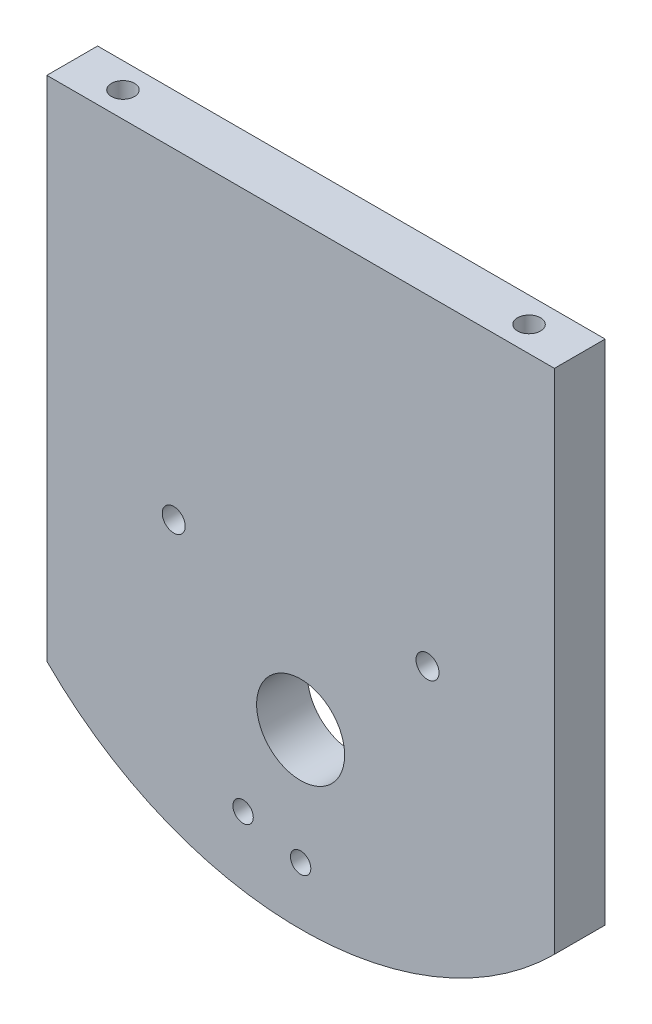
ISO-10303-21;
HEADER;
FILE_DESCRIPTION(('STEP AP214'),'2;1');
FILE_NAME('part.step','',(''),(''),'','','');
FILE_SCHEMA(('AUTOMOTIVE_DESIGN { 1 0 10303 214 1 1 1 1 }'));
ENDSEC;
DATA;
#1=APPLICATION_CONTEXT('core data for automotive mechanical design processes');
#2=APPLICATION_PROTOCOL_DEFINITION('international standard','automotive_design',2000,#1);
#3=PRODUCT_CONTEXT('',#1,'mechanical');
#4=PRODUCT('Part','Part','',(#3));
#5=PRODUCT_RELATED_PRODUCT_CATEGORY('part','',(#4));
#6=PRODUCT_DEFINITION_FORMATION('','',#4);
#7=PRODUCT_DEFINITION_CONTEXT('part definition',#1,'design');
#8=PRODUCT_DEFINITION('design','',#6,#7);
#9=PRODUCT_DEFINITION_SHAPE('','',#8);
#10=(LENGTH_UNIT() NAMED_UNIT(*) SI_UNIT(.MILLI.,.METRE.));
#11=(NAMED_UNIT(*) PLANE_ANGLE_UNIT() SI_UNIT($,.RADIAN.));
#12=(NAMED_UNIT(*) SI_UNIT($,.STERADIAN.) SOLID_ANGLE_UNIT());
#13=UNCERTAINTY_MEASURE_WITH_UNIT(LENGTH_MEASURE(1.E-05),#10,'distance_accuracy_value','');
#14=(GEOMETRIC_REPRESENTATION_CONTEXT(3) GLOBAL_UNCERTAINTY_ASSIGNED_CONTEXT((#13)) GLOBAL_UNIT_ASSIGNED_CONTEXT((#10,
#11,#12)) REPRESENTATION_CONTEXT('',''));
#15=CARTESIAN_POINT('',(0.,0.,0.));
#16=DIRECTION('',(0.,0.,1.));
#17=DIRECTION('',(1.,0.,0.));
#18=AXIS2_PLACEMENT_3D('',#15,#16,#17);
#19=CARTESIAN_POINT('',(-75.,0.,15.));
#20=DIRECTION('',(-1.,0.,0.));
#21=DIRECTION('',(0.,0.,1.));
#22=AXIS2_PLACEMENT_3D('',#19,#20,#21);
#23=PLANE('',#22);
#24=DIRECTION('',(0.,1.,0.));
#25=VECTOR('',#24,1.);
#26=CARTESIAN_POINT('',(-75.,0.,0.));
#27=LINE('',#26,#25);
#28=CARTESIAN_POINT('',(-75.,-105.,0.));
#29=VERTEX_POINT('',#28);
#30=CARTESIAN_POINT('',(-75.,45.,0.));
#31=VERTEX_POINT('',#30);
#32=EDGE_CURVE('E137',#29,#31,#27,.T.);
#33=ORIENTED_EDGE('',*,*,#32,.F.);
#34=DIRECTION('',(0.,0.,-1.));
#35=VECTOR('',#34,1.);
#36=CARTESIAN_POINT('',(-75.,-105.,15.));
#37=LINE('',#36,#35);
#38=CARTESIAN_POINT('',(-75.,-105.,15.));
#39=VERTEX_POINT('',#38);
#40=EDGE_CURVE('E11',#39,#29,#37,.T.);
#41=ORIENTED_EDGE('',*,*,#40,.F.);
#42=DIRECTION('',(0.,1.,0.));
#43=VECTOR('',#42,1.);
#44=CARTESIAN_POINT('',(-75.,0.,15.));
#45=LINE('',#44,#43);
#46=CARTESIAN_POINT('',(-75.,45.,15.));
#47=VERTEX_POINT('',#46);
#48=EDGE_CURVE('E140',#39,#47,#45,.T.);
#49=ORIENTED_EDGE('',*,*,#48,.T.);
#50=DIRECTION('',(0.,0.,-1.));
#51=VECTOR('',#50,1.);
#52=CARTESIAN_POINT('',(-75.,45.,15.));
#53=LINE('',#52,#51);
#54=EDGE_CURVE('E51',#47,#31,#53,.T.);
#55=ORIENTED_EDGE('',*,*,#54,.T.);
#56=EDGE_LOOP('',(#33,#41,#49,#55));
#57=FACE_BOUND('',#56,.T.);
#58=ADVANCED_FACE('F35',(#57),#23,.T.);
#59=CARTESIAN_POINT('',(0.,-30.,15.));
#60=DIRECTION('',(0.,0.,-1.));
#61=DIRECTION('',(-1.,0.,0.));
#62=AXIS2_PLACEMENT_3D('',#59,#60,#61);
#63=CYLINDRICAL_SURFACE('',#62,106.066017177982);
#64=CARTESIAN_POINT('',(0.,-30.,0.));
#65=DIRECTION('',(0.,0.,1.));
#66=DIRECTION('',(1.,0.,0.));
#67=AXIS2_PLACEMENT_3D('',#64,#65,#66);
#68=CIRCLE('',#67,106.066017177982);
#69=CARTESIAN_POINT('',(75.,-105.,0.));
#70=VERTEX_POINT('',#69);
#71=EDGE_CURVE('E150',#29,#70,#68,.T.);
#72=ORIENTED_EDGE('',*,*,#71,.T.);
#73=DIRECTION('',(0.,0.,-1.));
#74=VECTOR('',#73,1.);
#75=CARTESIAN_POINT('',(75.,-105.,15.));
#76=LINE('',#75,#74);
#77=CARTESIAN_POINT('',(75.,-105.,15.));
#78=VERTEX_POINT('',#77);
#79=EDGE_CURVE('E43',#78,#70,#76,.T.);
#80=ORIENTED_EDGE('',*,*,#79,.F.);
#81=CARTESIAN_POINT('',(0.,-30.,15.));
#82=DIRECTION('',(0.,0.,1.));
#83=DIRECTION('',(1.,0.,0.));
#84=AXIS2_PLACEMENT_3D('',#81,#82,#83);
#85=CIRCLE('',#84,106.066017177982);
#86=EDGE_CURVE('E142',#39,#78,#85,.T.);
#87=ORIENTED_EDGE('',*,*,#86,.F.);
#88=ORIENTED_EDGE('',*,*,#40,.T.);
#89=EDGE_LOOP('',(#72,#80,#87,#88));
#90=FACE_BOUND('',#89,.T.);
#91=ADVANCED_FACE('F178',(#90),#63,.T.);
#92=CARTESIAN_POINT('',(75.,0.,15.));
#93=DIRECTION('',(-1.,0.,0.));
#94=DIRECTION('',(0.,0.,1.));
#95=AXIS2_PLACEMENT_3D('',#92,#93,#94);
#96=PLANE('',#95);
#97=DIRECTION('',(0.,1.,0.));
#98=VECTOR('',#97,1.);
#99=CARTESIAN_POINT('',(75.,0.,0.));
#100=LINE('',#99,#98);
#101=CARTESIAN_POINT('',(75.,45.,0.));
#102=VERTEX_POINT('',#101);
#103=EDGE_CURVE('E152',#70,#102,#100,.T.);
#104=ORIENTED_EDGE('',*,*,#103,.T.);
#105=DIRECTION('',(0.,0.,-1.));
#106=VECTOR('',#105,1.);
#107=CARTESIAN_POINT('',(75.,45.,15.));
#108=LINE('',#107,#106);
#109=CARTESIAN_POINT('',(75.,45.,15.));
#110=VERTEX_POINT('',#109);
#111=EDGE_CURVE('E66',#110,#102,#108,.T.);
#112=ORIENTED_EDGE('',*,*,#111,.F.);
#113=DIRECTION('',(0.,1.,0.));
#114=VECTOR('',#113,1.);
#115=CARTESIAN_POINT('',(75.,0.,15.));
#116=LINE('',#115,#114);
#117=EDGE_CURVE('E145',#78,#110,#116,.T.);
#118=ORIENTED_EDGE('',*,*,#117,.F.);
#119=ORIENTED_EDGE('',*,*,#79,.T.);
#120=EDGE_LOOP('',(#104,#112,#118,#119));
#121=FACE_BOUND('',#120,.T.);
#122=ADVANCED_FACE('F162',(#121),#96,.F.);
#123=CARTESIAN_POINT('',(0.,45.,15.));
#124=DIRECTION('',(0.,1.,0.));
#125=DIRECTION('',(0.,0.,1.));
#126=AXIS2_PLACEMENT_3D('',#123,#124,#125);
#127=PLANE('',#126);
#128=CARTESIAN_POINT('',(-60.,45.,7.5));
#129=DIRECTION('',(0.,1.,0.));
#130=DIRECTION('',(0.,0.,1.));
#131=AXIS2_PLACEMENT_3D('',#128,#129,#130);
#132=CIRCLE('',#131,3.39999999999999);
#133=CARTESIAN_POINT('',(-60.,45.,10.9));
#134=VERTEX_POINT('',#133);
#135=EDGE_CURVE('E99',#134,#134,#132,.T.);
#136=ORIENTED_EDGE('',*,*,#135,.F.);
#137=EDGE_LOOP('',(#136));
#138=FACE_BOUND('',#137,.T.);
#139=CARTESIAN_POINT('',(60.,45.,7.5));
#140=DIRECTION('',(0.,1.,0.));
#141=DIRECTION('',(0.,0.,1.));
#142=AXIS2_PLACEMENT_3D('',#139,#140,#141);
#143=CIRCLE('',#142,3.39999999999999);
#144=CARTESIAN_POINT('',(60.,45.,10.9));
#145=VERTEX_POINT('',#144);
#146=EDGE_CURVE('E98',#145,#145,#143,.T.);
#147=ORIENTED_EDGE('',*,*,#146,.F.);
#148=EDGE_LOOP('',(#147));
#149=FACE_BOUND('',#148,.T.);
#150=DIRECTION('',(1.,0.,0.));
#151=VECTOR('',#150,1.);
#152=CARTESIAN_POINT('',(0.,45.,0.));
#153=LINE('',#152,#151);
#154=EDGE_CURVE('E143',#31,#102,#153,.T.);
#155=ORIENTED_EDGE('',*,*,#154,.F.);
#156=ORIENTED_EDGE('',*,*,#54,.F.);
#157=DIRECTION('',(1.,0.,0.));
#158=VECTOR('',#157,1.);
#159=CARTESIAN_POINT('',(0.,45.,15.));
#160=LINE('',#159,#158);
#161=EDGE_CURVE('E147',#47,#110,#160,.T.);
#162=ORIENTED_EDGE('',*,*,#161,.T.);
#163=ORIENTED_EDGE('',*,*,#111,.T.);
#164=EDGE_LOOP('',(#155,#156,#162,#163));
#165=FACE_BOUND('',#164,.T.);
#166=ADVANCED_FACE('F167',(#138,#149,#165),#127,.T.);
#167=CARTESIAN_POINT('',(0.,0.,15.));
#168=DIRECTION('',(0.,0.,1.));
#169=DIRECTION('',(1.,0.,0.));
#170=AXIS2_PLACEMENT_3D('',#167,#168,#169);
#171=PLANE('',#170);
#172=CARTESIAN_POINT('',(-37.5,-50.,15.));
#173=DIRECTION('',(0.,0.,1.));
#174=DIRECTION('',(1.,0.,0.));
#175=AXIS2_PLACEMENT_3D('',#172,#173,#174);
#176=CIRCLE('',#175,3.4);
#177=CARTESIAN_POINT('',(-34.1,-50.,15.));
#178=VERTEX_POINT('',#177);
#179=EDGE_CURVE('E109',#178,#178,#176,.T.);
#180=ORIENTED_EDGE('',*,*,#179,.F.);
#181=EDGE_LOOP('',(#180));
#182=FACE_BOUND('',#181,.T.);
#183=CARTESIAN_POINT('',(37.5,-50.,15.));
#184=DIRECTION('',(0.,0.,1.));
#185=DIRECTION('',(1.,0.,0.));
#186=AXIS2_PLACEMENT_3D('',#183,#184,#185);
#187=CIRCLE('',#186,3.4);
#188=CARTESIAN_POINT('',(40.9,-50.,15.));
#189=VERTEX_POINT('',#188);
#190=EDGE_CURVE('E115',#189,#189,#187,.T.);
#191=ORIENTED_EDGE('',*,*,#190,.F.);
#192=EDGE_LOOP('',(#191));
#193=FACE_BOUND('',#192,.T.);
#194=CARTESIAN_POINT('',(-16.9999999999998,-114.444863728671,15.));
#195=DIRECTION('',(0.,0.,1.));
#196=DIRECTION('',(1.,0.,0.));
#197=AXIS2_PLACEMENT_3D('',#194,#195,#196);
#198=CIRCLE('',#197,3.01000000000024);
#199=CARTESIAN_POINT('',(-13.9899999999996,-114.444863728671,15.));
#200=VERTEX_POINT('',#199);
#201=EDGE_CURVE('E121',#200,#200,#198,.T.);
#202=ORIENTED_EDGE('',*,*,#201,.F.);
#203=EDGE_LOOP('',(#202));
#204=FACE_BOUND('',#203,.T.);
#205=CARTESIAN_POINT('',(0.,-119.,15.));
#206=DIRECTION('',(0.,0.,1.));
#207=DIRECTION('',(1.,0.,0.));
#208=AXIS2_PLACEMENT_3D('',#205,#206,#207);
#209=CIRCLE('',#208,3.01);
#210=CARTESIAN_POINT('',(3.01000000000002,-119.,15.));
#211=VERTEX_POINT('',#210);
#212=EDGE_CURVE('E125',#211,#211,#209,.T.);
#213=ORIENTED_EDGE('',*,*,#212,.F.);
#214=EDGE_LOOP('',(#213));
#215=FACE_BOUND('',#214,.T.);
#216=CARTESIAN_POINT('',(0.,-85.,15.));
#217=DIRECTION('',(0.,0.,1.));
#218=DIRECTION('',(1.,0.,0.));
#219=AXIS2_PLACEMENT_3D('',#216,#217,#218);
#220=CIRCLE('',#219,13.005);
#221=CARTESIAN_POINT('',(13.005,-85.,15.));
#222=VERTEX_POINT('',#221);
#223=EDGE_CURVE('E131',#222,#222,#220,.T.);
#224=ORIENTED_EDGE('',*,*,#223,.F.);
#225=EDGE_LOOP('',(#224));
#226=FACE_BOUND('',#225,.T.);
#227=ORIENTED_EDGE('',*,*,#48,.F.);
#228=ORIENTED_EDGE('',*,*,#86,.T.);
#229=ORIENTED_EDGE('',*,*,#117,.T.);
#230=ORIENTED_EDGE('',*,*,#161,.F.);
#231=EDGE_LOOP('',(#227,#228,#229,#230));
#232=FACE_BOUND('',#231,.T.);
#233=ADVANCED_FACE('F169',(#182,#193,#204,#215,#226,#232),#171,.T.);
#234=CARTESIAN_POINT('',(0.,0.,0.));
#235=DIRECTION('',(0.,0.,1.));
#236=DIRECTION('',(1.,0.,0.));
#237=AXIS2_PLACEMENT_3D('',#234,#235,#236);
#238=PLANE('',#237);
#239=CARTESIAN_POINT('',(-16.9999999999998,-114.444863728671,0.));
#240=DIRECTION('',(0.,0.,1.));
#241=DIRECTION('',(1.,0.,0.));
#242=AXIS2_PLACEMENT_3D('',#239,#240,#241);
#243=CIRCLE('',#242,3.01000000000024);
#244=CARTESIAN_POINT('',(-13.9899999999996,-114.444863728671,0.));
#245=VERTEX_POINT('',#244);
#246=EDGE_CURVE('E122',#245,#245,#243,.T.);
#247=ORIENTED_EDGE('',*,*,#246,.T.);
#248=EDGE_LOOP('',(#247));
#249=FACE_BOUND('',#248,.T.);
#250=CARTESIAN_POINT('',(0.,-119.,0.));
#251=DIRECTION('',(0.,0.,1.));
#252=DIRECTION('',(1.,0.,0.));
#253=AXIS2_PLACEMENT_3D('',#250,#251,#252);
#254=CIRCLE('',#253,3.01);
#255=CARTESIAN_POINT('',(3.01000000000002,-119.,0.));
#256=VERTEX_POINT('',#255);
#257=EDGE_CURVE('E128',#256,#256,#254,.T.);
#258=ORIENTED_EDGE('',*,*,#257,.T.);
#259=EDGE_LOOP('',(#258));
#260=FACE_BOUND('',#259,.T.);
#261=CARTESIAN_POINT('',(0.,-85.,0.));
#262=DIRECTION('',(0.,0.,1.));
#263=DIRECTION('',(1.,0.,0.));
#264=AXIS2_PLACEMENT_3D('',#261,#262,#263);
#265=CIRCLE('',#264,13.005);
#266=CARTESIAN_POINT('',(13.005,-85.,0.));
#267=VERTEX_POINT('',#266);
#268=EDGE_CURVE('E134',#267,#267,#265,.T.);
#269=ORIENTED_EDGE('',*,*,#268,.T.);
#270=EDGE_LOOP('',(#269));
#271=FACE_BOUND('',#270,.T.);
#272=ORIENTED_EDGE('',*,*,#32,.T.);
#273=ORIENTED_EDGE('',*,*,#154,.T.);
#274=ORIENTED_EDGE('',*,*,#103,.F.);
#275=ORIENTED_EDGE('',*,*,#71,.F.);
#276=EDGE_LOOP('',(#272,#273,#274,#275));
#277=FACE_BOUND('',#276,.T.);
#278=ADVANCED_FACE('F166',(#249,#260,#271,#277),#238,.F.);
#279=CARTESIAN_POINT('',(0.,-85.,0.));
#280=DIRECTION('',(0.,0.,1.));
#281=DIRECTION('',(1.,0.,0.));
#282=AXIS2_PLACEMENT_3D('',#279,#280,#281);
#283=CYLINDRICAL_SURFACE('',#282,13.005);
#284=ORIENTED_EDGE('',*,*,#268,.F.);
#285=EDGE_LOOP('',(#284));
#286=FACE_BOUND('',#285,.T.);
#287=ORIENTED_EDGE('',*,*,#223,.T.);
#288=EDGE_LOOP('',(#287));
#289=FACE_BOUND('',#288,.T.);
#290=ADVANCED_FACE('F207',(#286,#289),#283,.F.);
#291=CARTESIAN_POINT('',(0.,-119.,0.));
#292=DIRECTION('',(0.,0.,1.));
#293=DIRECTION('',(1.,0.,0.));
#294=AXIS2_PLACEMENT_3D('',#291,#292,#293);
#295=CYLINDRICAL_SURFACE('',#294,3.01);
#296=ORIENTED_EDGE('',*,*,#257,.F.);
#297=EDGE_LOOP('',(#296));
#298=FACE_BOUND('',#297,.T.);
#299=ORIENTED_EDGE('',*,*,#212,.T.);
#300=EDGE_LOOP('',(#299));
#301=FACE_BOUND('',#300,.T.);
#302=ADVANCED_FACE('F217',(#298,#301),#295,.F.);
#303=CARTESIAN_POINT('',(-16.9999999999998,-114.444863728671,0.));
#304=DIRECTION('',(0.,0.,1.));
#305=DIRECTION('',(1.,0.,0.));
#306=AXIS2_PLACEMENT_3D('',#303,#304,#305);
#307=CYLINDRICAL_SURFACE('',#306,3.01000000000024);
#308=ORIENTED_EDGE('',*,*,#246,.F.);
#309=EDGE_LOOP('',(#308));
#310=FACE_BOUND('',#309,.T.);
#311=ORIENTED_EDGE('',*,*,#201,.T.);
#312=EDGE_LOOP('',(#311));
#313=FACE_BOUND('',#312,.T.);
#314=ADVANCED_FACE('F227',(#310,#313),#307,.F.);
#315=CARTESIAN_POINT('',(37.5,-50.,5.));
#316=DIRECTION('',(0.,0.,1.));
#317=DIRECTION('',(1.,0.,0.));
#318=AXIS2_PLACEMENT_3D('',#315,#316,#317);
#319=CONICAL_SURFACE('',#318,3.4,1.02974425867665);
#320=CARTESIAN_POINT('',(37.5,-50.,2.95707389530629));
#321=VERTEX_POINT('',#320);
#322=VERTEX_LOOP('',#321);
#323=FACE_BOUND('',#322,.T.);
#324=CARTESIAN_POINT('',(37.5,-50.,5.));
#325=DIRECTION('',(0.,0.,1.));
#326=DIRECTION('',(1.,0.,0.));
#327=AXIS2_PLACEMENT_3D('',#324,#325,#326);
#328=CIRCLE('',#327,3.4);
#329=CARTESIAN_POINT('',(40.9,-50.,5.));
#330=VERTEX_POINT('',#329);
#331=EDGE_CURVE('E118',#330,#330,#328,.T.);
#332=ORIENTED_EDGE('',*,*,#331,.T.);
#333=EDGE_LOOP('',(#332));
#334=FACE_BOUND('',#333,.T.);
#335=ADVANCED_FACE('F237',(#323,#334),#319,.F.);
#336=CARTESIAN_POINT('',(37.5,-50.,15.));
#337=DIRECTION('',(0.,0.,1.));
#338=DIRECTION('',(1.,0.,0.));
#339=AXIS2_PLACEMENT_3D('',#336,#337,#338);
#340=CYLINDRICAL_SURFACE('',#339,3.4);
#341=ORIENTED_EDGE('',*,*,#331,.F.);
#342=EDGE_LOOP('',(#341));
#343=FACE_BOUND('',#342,.T.);
#344=ORIENTED_EDGE('',*,*,#190,.T.);
#345=EDGE_LOOP('',(#344));
#346=FACE_BOUND('',#345,.T.);
#347=ADVANCED_FACE('F255',(#343,#346),#340,.F.);
#348=CARTESIAN_POINT('',(-37.5,-50.,5.));
#349=DIRECTION('',(0.,0.,1.));
#350=DIRECTION('',(1.,0.,0.));
#351=AXIS2_PLACEMENT_3D('',#348,#349,#350);
#352=CONICAL_SURFACE('',#351,3.4,1.02974425867665);
#353=CARTESIAN_POINT('',(-37.5,-50.,2.95707389530629));
#354=VERTEX_POINT('',#353);
#355=VERTEX_LOOP('',#354);
#356=FACE_BOUND('',#355,.T.);
#357=CARTESIAN_POINT('',(-37.5,-50.,5.));
#358=DIRECTION('',(0.,0.,1.));
#359=DIRECTION('',(1.,0.,0.));
#360=AXIS2_PLACEMENT_3D('',#357,#358,#359);
#361=CIRCLE('',#360,3.4);
#362=CARTESIAN_POINT('',(-34.1,-50.,5.));
#363=VERTEX_POINT('',#362);
#364=EDGE_CURVE('E112',#363,#363,#361,.T.);
#365=ORIENTED_EDGE('',*,*,#364,.T.);
#366=EDGE_LOOP('',(#365));
#367=FACE_BOUND('',#366,.T.);
#368=ADVANCED_FACE('F265',(#356,#367),#352,.F.);
#369=CARTESIAN_POINT('',(-37.5,-50.,15.));
#370=DIRECTION('',(0.,0.,1.));
#371=DIRECTION('',(1.,0.,0.));
#372=AXIS2_PLACEMENT_3D('',#369,#370,#371);
#373=CYLINDRICAL_SURFACE('',#372,3.4);
#374=ORIENTED_EDGE('',*,*,#364,.F.);
#375=EDGE_LOOP('',(#374));
#376=FACE_BOUND('',#375,.T.);
#377=ORIENTED_EDGE('',*,*,#179,.T.);
#378=EDGE_LOOP('',(#377));
#379=FACE_BOUND('',#378,.T.);
#380=ADVANCED_FACE('F275',(#376,#379),#373,.F.);
#381=CARTESIAN_POINT('',(60.,5.,7.5));
#382=DIRECTION('',(0.,1.,0.));
#383=DIRECTION('',(0.,0.,1.));
#384=AXIS2_PLACEMENT_3D('',#381,#382,#383);
#385=CONICAL_SURFACE('',#384,3.4,1.02974425867665);
#386=CARTESIAN_POINT('',(60.,2.95707389530628,7.5));
#387=VERTEX_POINT('',#386);
#388=VERTEX_LOOP('',#387);
#389=FACE_BOUND('',#388,.T.);
#390=CARTESIAN_POINT('',(60.,5.,7.5));
#391=DIRECTION('',(0.,1.,0.));
#392=DIRECTION('',(0.,0.,1.));
#393=AXIS2_PLACEMENT_3D('',#390,#391,#392);
#394=CIRCLE('',#393,3.4);
#395=CARTESIAN_POINT('',(60.,5.,10.9));
#396=VERTEX_POINT('',#395);
#397=EDGE_CURVE('E102',#396,#396,#394,.T.);
#398=ORIENTED_EDGE('',*,*,#397,.T.);
#399=EDGE_LOOP('',(#398));
#400=FACE_BOUND('',#399,.T.);
#401=ADVANCED_FACE('F284',(#389,#400),#385,.F.);
#402=CARTESIAN_POINT('',(60.,45.,7.5));
#403=DIRECTION('',(0.,1.,0.));
#404=DIRECTION('',(0.,0.,1.));
#405=AXIS2_PLACEMENT_3D('',#402,#403,#404);
#406=CYLINDRICAL_SURFACE('',#405,3.39999999999999);
#407=ORIENTED_EDGE('',*,*,#397,.F.);
#408=EDGE_LOOP('',(#407));
#409=FACE_BOUND('',#408,.T.);
#410=ORIENTED_EDGE('',*,*,#146,.T.);
#411=EDGE_LOOP('',(#410));
#412=FACE_BOUND('',#411,.T.);
#413=ADVANCED_FACE('F92',(#409,#412),#406,.F.);
#414=CARTESIAN_POINT('',(-60.,5.,7.5));
#415=DIRECTION('',(0.,1.,0.));
#416=DIRECTION('',(0.,0.,1.));
#417=AXIS2_PLACEMENT_3D('',#414,#415,#416);
#418=CONICAL_SURFACE('',#417,3.39999999999999,1.02974425867665);
#419=CARTESIAN_POINT('',(-60.,2.95707389530628,7.5));
#420=VERTEX_POINT('',#419);
#421=VERTEX_LOOP('',#420);
#422=FACE_BOUND('',#421,.T.);
#423=CARTESIAN_POINT('',(-60.,5.,7.5));
#424=DIRECTION('',(0.,1.,0.));
#425=DIRECTION('',(0.,0.,1.));
#426=AXIS2_PLACEMENT_3D('',#423,#424,#425);
#427=CIRCLE('',#426,3.39999999999999);
#428=CARTESIAN_POINT('',(-60.,5.,10.9));
#429=VERTEX_POINT('',#428);
#430=EDGE_CURVE('E96',#429,#429,#427,.T.);
#431=ORIENTED_EDGE('',*,*,#430,.T.);
#432=EDGE_LOOP('',(#431));
#433=FACE_BOUND('',#432,.T.);
#434=ADVANCED_FACE('F88',(#422,#433),#418,.F.);
#435=CARTESIAN_POINT('',(-60.,45.,7.5));
#436=DIRECTION('',(0.,1.,0.));
#437=DIRECTION('',(0.,0.,1.));
#438=AXIS2_PLACEMENT_3D('',#435,#436,#437);
#439=CYLINDRICAL_SURFACE('',#438,3.39999999999999);
#440=ORIENTED_EDGE('',*,*,#430,.F.);
#441=EDGE_LOOP('',(#440));
#442=FACE_BOUND('',#441,.T.);
#443=ORIENTED_EDGE('',*,*,#135,.T.);
#444=EDGE_LOOP('',(#443));
#445=FACE_BOUND('',#444,.T.);
#446=ADVANCED_FACE('F91',(#442,#445),#439,.F.);
#447=CLOSED_SHELL('',(#58,#91,#122,#166,#233,#278,#290,#302,#314,#335,#347,#368,#380,#401,#413,
#434,#446));
#448=MANIFOLD_SOLID_BREP('B2',#447);
#449=ADVANCED_BREP_SHAPE_REPRESENTATION('',(#18,#448),#14);
#450=SHAPE_DEFINITION_REPRESENTATION(#9,#449);
ENDSEC;
END-ISO-10303-21;
